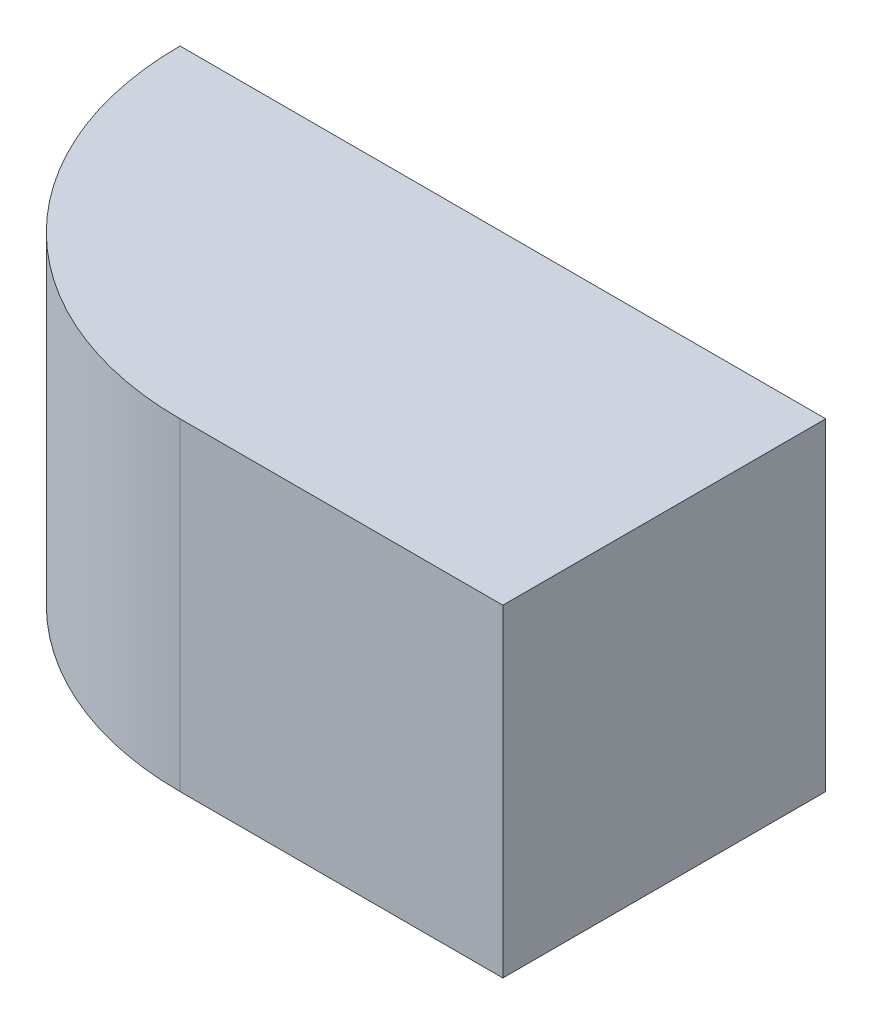
ISO-10303-21;
HEADER;
FILE_DESCRIPTION(('STEP AP214'),'2;1');
FILE_NAME('part.step','',(''),(''),'','','');
FILE_SCHEMA(('AUTOMOTIVE_DESIGN { 1 0 10303 214 1 1 1 1 }'));
ENDSEC;
DATA;
#1=APPLICATION_CONTEXT('core data for automotive mechanical design processes');
#2=APPLICATION_PROTOCOL_DEFINITION('international standard','automotive_design',2000,#1);
#3=PRODUCT_CONTEXT('',#1,'mechanical');
#4=PRODUCT('Part','Part','',(#3));
#5=PRODUCT_RELATED_PRODUCT_CATEGORY('part','',(#4));
#6=PRODUCT_DEFINITION_FORMATION('','',#4);
#7=PRODUCT_DEFINITION_CONTEXT('part definition',#1,'design');
#8=PRODUCT_DEFINITION('design','',#6,#7);
#9=PRODUCT_DEFINITION_SHAPE('','',#8);
#10=(LENGTH_UNIT() NAMED_UNIT(*) SI_UNIT(.MILLI.,.METRE.));
#11=(NAMED_UNIT(*) PLANE_ANGLE_UNIT() SI_UNIT($,.RADIAN.));
#12=(NAMED_UNIT(*) SI_UNIT($,.STERADIAN.) SOLID_ANGLE_UNIT());
#13=UNCERTAINTY_MEASURE_WITH_UNIT(LENGTH_MEASURE(1.E-05),#10,'distance_accuracy_value','');
#14=(GEOMETRIC_REPRESENTATION_CONTEXT(3) GLOBAL_UNCERTAINTY_ASSIGNED_CONTEXT((#13)) GLOBAL_UNIT_ASSIGNED_CONTEXT((#10,
#11,#12)) REPRESENTATION_CONTEXT('',''));
#15=CARTESIAN_POINT('',(0.,0.,0.));
#16=DIRECTION('',(0.,0.,1.));
#17=DIRECTION('',(1.,0.,0.));
#18=AXIS2_PLACEMENT_3D('',#15,#16,#17);
#19=CARTESIAN_POINT('',(-2.00000002980232,-5.75000013038516,2.));
#20=DIRECTION('',(0.,0.,1.));
#21=DIRECTION('',(1.,0.,0.));
#22=AXIS2_PLACEMENT_3D('',#19,#20,#21);
#23=PLANE('',#22);
#24=DIRECTION('',(-1.,0.,0.));
#25=VECTOR('',#24,1.);
#26=CARTESIAN_POINT('',(-1.50000002235174,-6.00000013411045,2.));
#27=LINE('',#26,#25);
#28=CARTESIAN_POINT('',(-1.50000002235174,-6.00000013411045,2.));
#29=VERTEX_POINT('',#28);
#30=CARTESIAN_POINT('',(-2.5000000372529,-6.00000013411045,2.));
#31=VERTEX_POINT('',#30);
#32=EDGE_CURVE('E21',#29,#31,#27,.T.);
#33=ORIENTED_EDGE('',*,*,#32,.T.);
#34=DIRECTION('',(0.,1.,0.));
#35=VECTOR('',#34,1.);
#36=CARTESIAN_POINT('',(-2.5000000372529,-6.00000013411045,2.));
#37=LINE('',#36,#35);
#38=CARTESIAN_POINT('',(-2.5000000372529,-5.50000012665987,2.));
#39=VERTEX_POINT('',#38);
#40=EDGE_CURVE('E70',#31,#39,#37,.T.);
#41=ORIENTED_EDGE('',*,*,#40,.T.);
#42=DIRECTION('',(1.,0.,0.));
#43=VECTOR('',#42,1.);
#44=CARTESIAN_POINT('',(-2.5000000372529,-5.50000012665987,2.));
#45=LINE('',#44,#43);
#46=CARTESIAN_POINT('',(-1.50000002235174,-5.50000012665987,2.));
#47=VERTEX_POINT('',#46);
#48=EDGE_CURVE('E103',#39,#47,#45,.T.);
#49=ORIENTED_EDGE('',*,*,#48,.T.);
#50=DIRECTION('',(0.,-1.,0.));
#51=VECTOR('',#50,1.);
#52=CARTESIAN_POINT('',(-1.50000002235174,-5.50000012665987,2.));
#53=LINE('',#52,#51);
#54=EDGE_CURVE('E27',#47,#29,#53,.T.);
#55=ORIENTED_EDGE('',*,*,#54,.T.);
#56=EDGE_LOOP('',(#33,#41,#49,#55));
#57=FACE_BOUND('',#56,.T.);
#58=ADVANCED_FACE('F17',(#57),#23,.F.);
#59=CARTESIAN_POINT('',(-2.00000002980232,-5.75000013038516,2.5));
#60=DIRECTION('',(0.,0.,1.));
#61=DIRECTION('',(1.,0.,0.));
#62=AXIS2_PLACEMENT_3D('',#59,#60,#61);
#63=PLANE('',#62);
#64=DIRECTION('',(0.,1.,0.));
#65=VECTOR('',#64,1.);
#66=CARTESIAN_POINT('',(-2.0000000372529,-5.62500012852252,2.5));
#67=LINE('',#66,#65);
#68=CARTESIAN_POINT('',(-2.0000000372529,-6.00000013411045,2.5));
#69=VERTEX_POINT('',#68);
#70=CARTESIAN_POINT('',(-2.0000000372529,-5.50000012665987,2.5));
#71=VERTEX_POINT('',#70);
#72=EDGE_CURVE('E90',#69,#71,#67,.T.);
#73=ORIENTED_EDGE('',*,*,#72,.F.);
#74=DIRECTION('',(1.,0.,0.));
#75=VECTOR('',#74,1.);
#76=CARTESIAN_POINT('',(-1.50000002235174,-6.00000013411045,2.5));
#77=LINE('',#76,#75);
#78=CARTESIAN_POINT('',(-1.50000002235174,-6.00000013411045,2.5));
#79=VERTEX_POINT('',#78);
#80=EDGE_CURVE('E87',#69,#79,#77,.T.);
#81=ORIENTED_EDGE('',*,*,#80,.T.);
#82=DIRECTION('',(0.,1.,0.));
#83=VECTOR('',#82,1.);
#84=CARTESIAN_POINT('',(-1.50000002235174,-5.50000012665987,2.5));
#85=LINE('',#84,#83);
#86=CARTESIAN_POINT('',(-1.50000002235174,-5.50000012665987,2.5));
#87=VERTEX_POINT('',#86);
#88=EDGE_CURVE('E11',#79,#87,#85,.T.);
#89=ORIENTED_EDGE('',*,*,#88,.T.);
#90=DIRECTION('',(-1.,0.,0.));
#91=VECTOR('',#90,1.);
#92=CARTESIAN_POINT('',(-2.5000000372529,-5.50000012665987,2.5));
#93=LINE('',#92,#91);
#94=EDGE_CURVE('E99',#87,#71,#93,.T.);
#95=ORIENTED_EDGE('',*,*,#94,.T.);
#96=EDGE_LOOP('',(#73,#81,#89,#95));
#97=FACE_BOUND('',#96,.T.);
#98=ADVANCED_FACE('F129',(#97),#63,.T.);
#99=CARTESIAN_POINT('',(-1.50000002235174,-6.00000013411045,2.));
#100=DIRECTION('',(1.,0.,0.));
#101=DIRECTION('',(0.,1.,0.));
#102=AXIS2_PLACEMENT_3D('',#99,#100,#101);
#103=PLANE('',#102);
#104=ORIENTED_EDGE('',*,*,#54,.F.);
#105=DIRECTION('',(0.,0.,1.));
#106=VECTOR('',#105,1.);
#107=CARTESIAN_POINT('',(-1.50000002235174,-5.50000012665987,2.));
#108=LINE('',#107,#106);
#109=EDGE_CURVE('E101',#47,#87,#108,.T.);
#110=ORIENTED_EDGE('',*,*,#109,.T.);
#111=ORIENTED_EDGE('',*,*,#88,.F.);
#112=DIRECTION('',(0.,0.,1.));
#113=VECTOR('',#112,1.);
#114=CARTESIAN_POINT('',(-1.50000002235174,-6.00000013411045,2.));
#115=LINE('',#114,#113);
#116=EDGE_CURVE('E76',#29,#79,#115,.T.);
#117=ORIENTED_EDGE('',*,*,#116,.F.);
#118=EDGE_LOOP('',(#104,#110,#111,#117));
#119=FACE_BOUND('',#118,.T.);
#120=ADVANCED_FACE('F19',(#119),#103,.T.);
#121=CARTESIAN_POINT('',(-1.50000002235174,-5.50000012665987,2.));
#122=DIRECTION('',(0.,1.,0.));
#123=DIRECTION('',(1.,0.,0.));
#124=AXIS2_PLACEMENT_3D('',#121,#122,#123);
#125=PLANE('',#124);
#126=CARTESIAN_POINT('',(-2.0000000372529,-5.50000012665987,2.));
#127=DIRECTION('',(0.,-1.,0.));
#128=DIRECTION('',(-0.707106781186548,0.,0.707106781186548));
#129=AXIS2_PLACEMENT_3D('',#126,#127,#128);
#130=CIRCLE('',#129,0.5);
#131=EDGE_CURVE('E83',#71,#39,#130,.T.);
#132=ORIENTED_EDGE('',*,*,#131,.F.);
#133=ORIENTED_EDGE('',*,*,#94,.F.);
#134=ORIENTED_EDGE('',*,*,#109,.F.);
#135=ORIENTED_EDGE('',*,*,#48,.F.);
#136=EDGE_LOOP('',(#132,#133,#134,#135));
#137=FACE_BOUND('',#136,.T.);
#138=ADVANCED_FACE('F121',(#137),#125,.T.);
#139=CARTESIAN_POINT('',(-2.5000000372529,-6.00000013411045,2.));
#140=DIRECTION('',(0.,-1.,0.));
#141=DIRECTION('',(0.,0.,-1.));
#142=AXIS2_PLACEMENT_3D('',#139,#140,#141);
#143=PLANE('',#142);
#144=CARTESIAN_POINT('',(-2.0000000372529,-6.00000013411045,2.));
#145=DIRECTION('',(0.,1.,0.));
#146=DIRECTION('',(-0.707106781186548,0.,0.707106781186548));
#147=AXIS2_PLACEMENT_3D('',#144,#145,#146);
#148=CIRCLE('',#147,0.5);
#149=EDGE_CURVE('E81',#31,#69,#148,.T.);
#150=ORIENTED_EDGE('',*,*,#149,.F.);
#151=ORIENTED_EDGE('',*,*,#32,.F.);
#152=ORIENTED_EDGE('',*,*,#116,.T.);
#153=ORIENTED_EDGE('',*,*,#80,.F.);
#154=EDGE_LOOP('',(#150,#151,#152,#153));
#155=FACE_BOUND('',#154,.T.);
#156=ADVANCED_FACE('F86',(#155),#143,.T.);
#157=CARTESIAN_POINT('',(-2.0000000372529,-5.62500012852252,2.));
#158=DIRECTION('',(0.,-1.,0.));
#159=DIRECTION('',(-0.707106781186548,0.,0.707106781186548));
#160=AXIS2_PLACEMENT_3D('',#157,#158,#159);
#161=CYLINDRICAL_SURFACE('',#160,0.5);
#162=ORIENTED_EDGE('',*,*,#149,.T.);
#163=ORIENTED_EDGE('',*,*,#72,.T.);
#164=ORIENTED_EDGE('',*,*,#131,.T.);
#165=ORIENTED_EDGE('',*,*,#40,.F.);
#166=EDGE_LOOP('',(#162,#163,#164,#165));
#167=FACE_BOUND('',#166,.T.);
#168=ADVANCED_FACE('F79',(#167),#161,.T.);
#169=CLOSED_SHELL('',(#58,#98,#120,#138,#156,#168));
#170=MANIFOLD_SOLID_BREP('B1',#169);
#171=ADVANCED_BREP_SHAPE_REPRESENTATION('',(#18,#170),#14);
#172=SHAPE_DEFINITION_REPRESENTATION(#9,#171);
ENDSEC;
END-ISO-10303-21;
